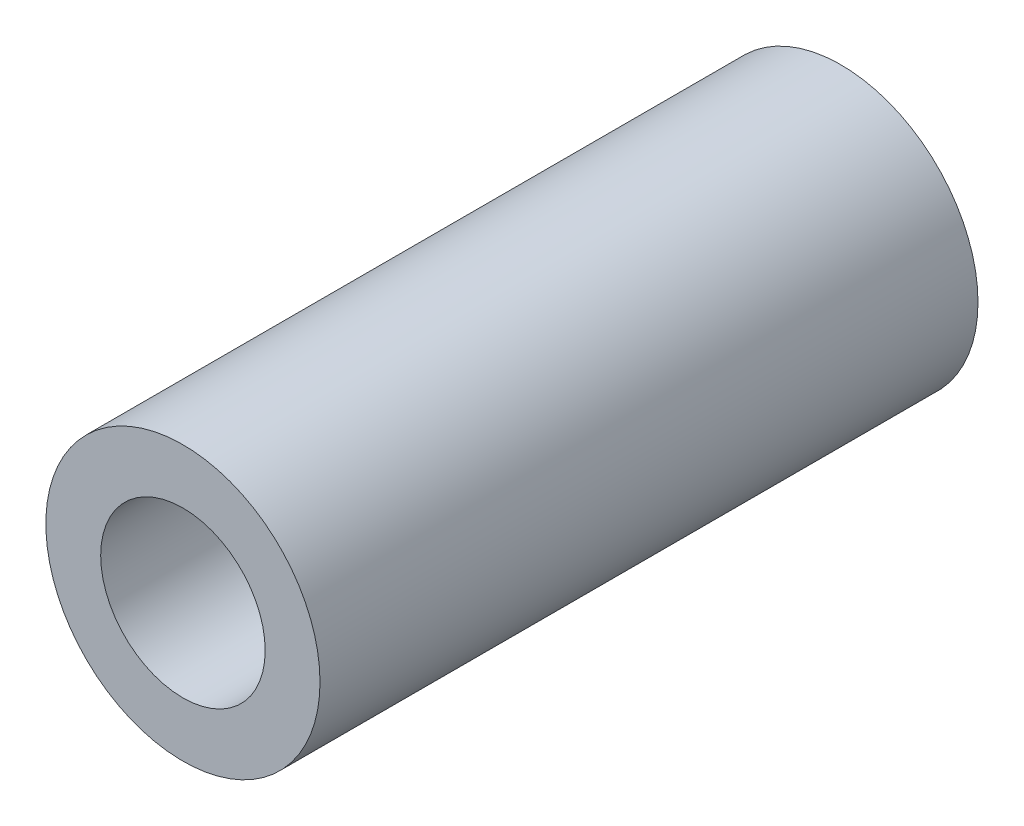
ISO-10303-21;
HEADER;
FILE_DESCRIPTION(('STEP AP214'),'2;1');
FILE_NAME('part.step','',(''),(''),'','','');
FILE_SCHEMA(('AUTOMOTIVE_DESIGN { 1 0 10303 214 1 1 1 1 }'));
ENDSEC;
DATA;
#1=APPLICATION_CONTEXT('core data for automotive mechanical design processes');
#2=APPLICATION_PROTOCOL_DEFINITION('international standard','automotive_design',2000,#1);
#3=PRODUCT_CONTEXT('',#1,'mechanical');
#4=PRODUCT('Part','Part','',(#3));
#5=PRODUCT_RELATED_PRODUCT_CATEGORY('part','',(#4));
#6=PRODUCT_DEFINITION_FORMATION('','',#4);
#7=PRODUCT_DEFINITION_CONTEXT('part definition',#1,'design');
#8=PRODUCT_DEFINITION('design','',#6,#7);
#9=PRODUCT_DEFINITION_SHAPE('','',#8);
#10=(LENGTH_UNIT() NAMED_UNIT(*) SI_UNIT(.MILLI.,.METRE.));
#11=(NAMED_UNIT(*) PLANE_ANGLE_UNIT() SI_UNIT($,.RADIAN.));
#12=(NAMED_UNIT(*) SI_UNIT($,.STERADIAN.) SOLID_ANGLE_UNIT());
#13=UNCERTAINTY_MEASURE_WITH_UNIT(LENGTH_MEASURE(1.E-05),#10,'distance_accuracy_value','');
#14=(GEOMETRIC_REPRESENTATION_CONTEXT(3) GLOBAL_UNCERTAINTY_ASSIGNED_CONTEXT((#13)) GLOBAL_UNIT_ASSIGNED_CONTEXT((#10,
#11,#12)) REPRESENTATION_CONTEXT('',''));
#15=CARTESIAN_POINT('',(0.,0.,0.));
#16=DIRECTION('',(0.,0.,1.));
#17=DIRECTION('',(1.,0.,0.));
#18=AXIS2_PLACEMENT_3D('',#15,#16,#17);
#19=CARTESIAN_POINT('',(0.,0.,12.));
#20=DIRECTION('',(0.,0.,1.));
#21=DIRECTION('',(1.,0.,0.));
#22=AXIS2_PLACEMENT_3D('',#19,#20,#21);
#23=PLANE('',#22);
#24=CARTESIAN_POINT('',(0.,0.,12.));
#25=DIRECTION('',(0.,0.,1.));
#26=DIRECTION('',(1.,0.,0.));
#27=AXIS2_PLACEMENT_3D('',#24,#25,#26);
#28=CIRCLE('',#27,2.5);
#29=CARTESIAN_POINT('',(2.5,0.,12.));
#30=VERTEX_POINT('',#29);
#31=EDGE_CURVE('E10',#30,#30,#28,.T.);
#32=ORIENTED_EDGE('',*,*,#31,.T.);
#33=EDGE_LOOP('',(#32));
#34=FACE_BOUND('',#33,.T.);
#35=CARTESIAN_POINT('',(0.,0.,12.));
#36=DIRECTION('',(0.,0.,1.));
#37=DIRECTION('',(1.,0.,0.));
#38=AXIS2_PLACEMENT_3D('',#35,#36,#37);
#39=CIRCLE('',#38,1.5);
#40=CARTESIAN_POINT('',(1.5,0.,12.));
#41=VERTEX_POINT('',#40);
#42=EDGE_CURVE('E43',#41,#41,#39,.T.);
#43=ORIENTED_EDGE('',*,*,#42,.F.);
#44=EDGE_LOOP('',(#43));
#45=FACE_BOUND('',#44,.T.);
#46=ADVANCED_FACE('F32',(#34,#45),#23,.T.);
#47=CARTESIAN_POINT('',(0.,0.,0.));
#48=DIRECTION('',(0.,0.,1.));
#49=DIRECTION('',(1.,0.,0.));
#50=AXIS2_PLACEMENT_3D('',#47,#48,#49);
#51=PLANE('',#50);
#52=CARTESIAN_POINT('',(0.,0.,0.));
#53=DIRECTION('',(0.,0.,1.));
#54=DIRECTION('',(1.,0.,0.));
#55=AXIS2_PLACEMENT_3D('',#52,#53,#54);
#56=CIRCLE('',#55,2.5);
#57=CARTESIAN_POINT('',(2.5,0.,0.));
#58=VERTEX_POINT('',#57);
#59=EDGE_CURVE('E36',#58,#58,#56,.T.);
#60=ORIENTED_EDGE('',*,*,#59,.F.);
#61=EDGE_LOOP('',(#60));
#62=FACE_BOUND('',#61,.T.);
#63=CARTESIAN_POINT('',(0.,0.,0.));
#64=DIRECTION('',(0.,0.,1.));
#65=DIRECTION('',(1.,0.,0.));
#66=AXIS2_PLACEMENT_3D('',#63,#64,#65);
#67=CIRCLE('',#66,1.5);
#68=CARTESIAN_POINT('',(1.5,0.,0.));
#69=VERTEX_POINT('',#68);
#70=EDGE_CURVE('E45',#69,#69,#67,.T.);
#71=ORIENTED_EDGE('',*,*,#70,.T.);
#72=EDGE_LOOP('',(#71));
#73=FACE_BOUND('',#72,.T.);
#74=ADVANCED_FACE('F55',(#62,#73),#51,.F.);
#75=CARTESIAN_POINT('',(0.,0.,12.));
#76=DIRECTION('',(0.,0.,-1.));
#77=DIRECTION('',(-1.,0.,0.));
#78=AXIS2_PLACEMENT_3D('',#75,#76,#77);
#79=CYLINDRICAL_SURFACE('',#78,2.5);
#80=ORIENTED_EDGE('',*,*,#31,.F.);
#81=EDGE_LOOP('',(#80));
#82=FACE_BOUND('',#81,.T.);
#83=ORIENTED_EDGE('',*,*,#59,.T.);
#84=EDGE_LOOP('',(#83));
#85=FACE_BOUND('',#84,.T.);
#86=ADVANCED_FACE('F34',(#82,#85),#79,.T.);
#87=CARTESIAN_POINT('',(0.,0.,12.));
#88=DIRECTION('',(0.,0.,-1.));
#89=DIRECTION('',(-1.,0.,0.));
#90=AXIS2_PLACEMENT_3D('',#87,#88,#89);
#91=CYLINDRICAL_SURFACE('',#90,1.5);
#92=ORIENTED_EDGE('',*,*,#42,.T.);
#93=EDGE_LOOP('',(#92));
#94=FACE_BOUND('',#93,.T.);
#95=ORIENTED_EDGE('',*,*,#70,.F.);
#96=EDGE_LOOP('',(#95));
#97=FACE_BOUND('',#96,.T.);
#98=ADVANCED_FACE('F51',(#94,#97),#91,.F.);
#99=CLOSED_SHELL('',(#46,#74,#86,#98));
#100=MANIFOLD_SOLID_BREP('B2',#99);
#101=ADVANCED_BREP_SHAPE_REPRESENTATION('',(#18,#100),#14);
#102=SHAPE_DEFINITION_REPRESENTATION(#9,#101);
ENDSEC;
END-ISO-10303-21;
